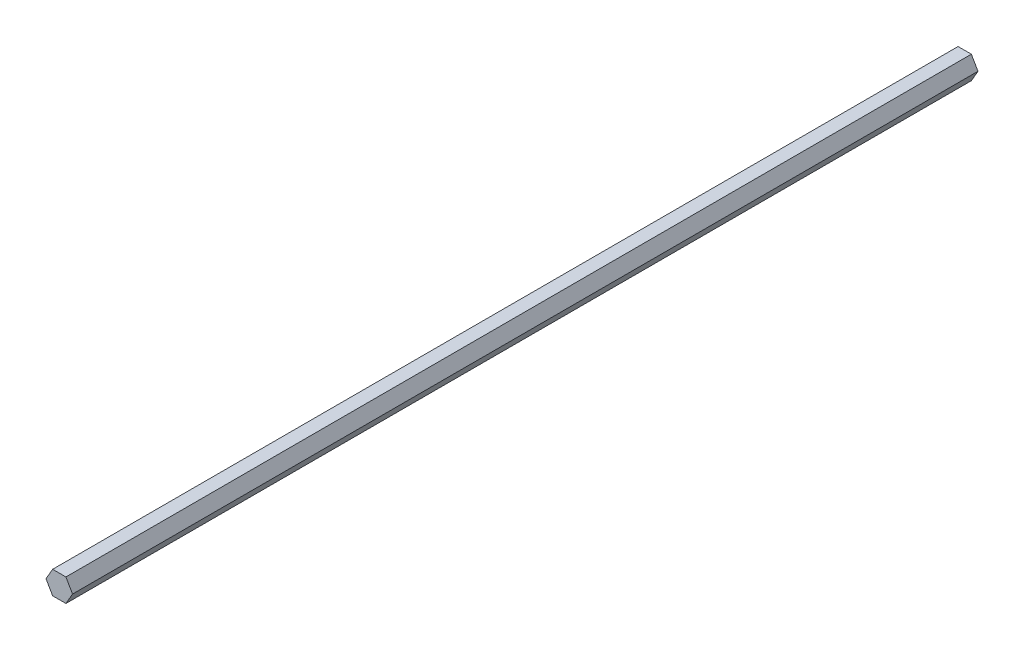
ISO-10303-21;
HEADER;
FILE_DESCRIPTION(('STEP AP214'),'2;1');
FILE_NAME('part.step','',(''),(''),'','','');
FILE_SCHEMA(('AUTOMOTIVE_DESIGN { 1 0 10303 214 1 1 1 1 }'));
ENDSEC;
DATA;
#1=APPLICATION_CONTEXT('core data for automotive mechanical design processes');
#2=APPLICATION_PROTOCOL_DEFINITION('international standard','automotive_design',2000,#1);
#3=PRODUCT_CONTEXT('',#1,'mechanical');
#4=PRODUCT('Part','Part','',(#3));
#5=PRODUCT_RELATED_PRODUCT_CATEGORY('part','',(#4));
#6=PRODUCT_DEFINITION_FORMATION('','',#4);
#7=PRODUCT_DEFINITION_CONTEXT('part definition',#1,'design');
#8=PRODUCT_DEFINITION('design','',#6,#7);
#9=PRODUCT_DEFINITION_SHAPE('','',#8);
#10=(LENGTH_UNIT() NAMED_UNIT(*) SI_UNIT(.MILLI.,.METRE.));
#11=(NAMED_UNIT(*) PLANE_ANGLE_UNIT() SI_UNIT($,.RADIAN.));
#12=(NAMED_UNIT(*) SI_UNIT($,.STERADIAN.) SOLID_ANGLE_UNIT());
#13=UNCERTAINTY_MEASURE_WITH_UNIT(LENGTH_MEASURE(1.E-05),#10,'distance_accuracy_value','');
#14=(GEOMETRIC_REPRESENTATION_CONTEXT(3) GLOBAL_UNCERTAINTY_ASSIGNED_CONTEXT((#13)) GLOBAL_UNIT_ASSIGNED_CONTEXT((#10,
#11,#12)) REPRESENTATION_CONTEXT('',''));
#15=CARTESIAN_POINT('',(0.,0.,0.));
#16=DIRECTION('',(0.,0.,1.));
#17=DIRECTION('',(1.,0.,0.));
#18=AXIS2_PLACEMENT_3D('',#15,#16,#17);
#19=CARTESIAN_POINT('',(3.665,6.34796620973994,500.));
#20=DIRECTION('',(0.,-1.,0.));
#21=DIRECTION('',(1.,0.,0.));
#22=AXIS2_PLACEMENT_3D('',#19,#20,#21);
#23=PLANE('',#22);
#24=DIRECTION('',(-1.,0.,0.));
#25=VECTOR('',#24,1.);
#26=CARTESIAN_POINT('',(3.665,6.34796620973994,0.));
#27=LINE('',#26,#25);
#28=CARTESIAN_POINT('',(3.665,6.34796620973994,0.));
#29=VERTEX_POINT('',#28);
#30=CARTESIAN_POINT('',(-3.665,6.34796620973993,0.));
#31=VERTEX_POINT('',#30);
#32=EDGE_CURVE('E116',#29,#31,#27,.T.);
#33=ORIENTED_EDGE('',*,*,#32,.T.);
#34=DIRECTION('',(0.,0.,-1.));
#35=VECTOR('',#34,1.);
#36=CARTESIAN_POINT('',(-3.665,6.34796620973993,500.));
#37=LINE('',#36,#35);
#38=CARTESIAN_POINT('',(-3.665,6.34796620973993,500.));
#39=VERTEX_POINT('',#38);
#40=EDGE_CURVE('E11',#39,#31,#37,.T.);
#41=ORIENTED_EDGE('',*,*,#40,.F.);
#42=DIRECTION('',(-1.,0.,0.));
#43=VECTOR('',#42,1.);
#44=CARTESIAN_POINT('',(3.665,6.34796620973994,500.));
#45=LINE('',#44,#43);
#46=CARTESIAN_POINT('',(3.665,6.34796620973994,500.));
#47=VERTEX_POINT('',#46);
#48=EDGE_CURVE('E126',#47,#39,#45,.T.);
#49=ORIENTED_EDGE('',*,*,#48,.F.);
#50=DIRECTION('',(0.,0.,-1.));
#51=VECTOR('',#50,1.);
#52=CARTESIAN_POINT('',(3.665,6.34796620973994,500.));
#53=LINE('',#52,#51);
#54=EDGE_CURVE('E112',#47,#29,#53,.T.);
#55=ORIENTED_EDGE('',*,*,#54,.T.);
#56=EDGE_LOOP('',(#33,#41,#49,#55));
#57=FACE_BOUND('',#56,.T.);
#58=ADVANCED_FACE('F32',(#57),#23,.F.);
#59=CARTESIAN_POINT('',(-3.665,6.34796620973993,500.));
#60=DIRECTION('',(0.866025403784439,-0.5,0.));
#61=DIRECTION('',(0.5,0.866025403784439,0.));
#62=AXIS2_PLACEMENT_3D('',#59,#60,#61);
#63=PLANE('',#62);
#64=DIRECTION('',(-0.5,-0.866025403784439,0.));
#65=VECTOR('',#64,1.);
#66=CARTESIAN_POINT('',(-3.665,6.34796620973993,0.));
#67=LINE('',#66,#65);
#68=CARTESIAN_POINT('',(-7.33,0.,0.));
#69=VERTEX_POINT('',#68);
#70=EDGE_CURVE('E119',#31,#69,#67,.T.);
#71=ORIENTED_EDGE('',*,*,#70,.T.);
#72=DIRECTION('',(0.,0.,-1.));
#73=VECTOR('',#72,1.);
#74=CARTESIAN_POINT('',(-7.33,0.,500.));
#75=LINE('',#74,#73);
#76=CARTESIAN_POINT('',(-7.33,0.,500.));
#77=VERTEX_POINT('',#76);
#78=EDGE_CURVE('E40',#77,#69,#75,.T.);
#79=ORIENTED_EDGE('',*,*,#78,.F.);
#80=DIRECTION('',(-0.5,-0.866025403784439,0.));
#81=VECTOR('',#80,1.);
#82=CARTESIAN_POINT('',(-3.665,6.34796620973993,500.));
#83=LINE('',#82,#81);
#84=EDGE_CURVE('E85',#39,#77,#83,.T.);
#85=ORIENTED_EDGE('',*,*,#84,.F.);
#86=ORIENTED_EDGE('',*,*,#40,.T.);
#87=EDGE_LOOP('',(#71,#79,#85,#86));
#88=FACE_BOUND('',#87,.T.);
#89=ADVANCED_FACE('F150',(#88),#63,.F.);
#90=CARTESIAN_POINT('',(-7.33,0.,500.));
#91=DIRECTION('',(0.866025403784439,0.5,0.));
#92=DIRECTION('',(-0.5,0.866025403784439,0.));
#93=AXIS2_PLACEMENT_3D('',#90,#91,#92);
#94=PLANE('',#93);
#95=DIRECTION('',(0.5,-0.866025403784439,0.));
#96=VECTOR('',#95,1.);
#97=CARTESIAN_POINT('',(-7.33,0.,0.));
#98=LINE('',#97,#96);
#99=CARTESIAN_POINT('',(-3.665,-6.34796620973994,0.));
#100=VERTEX_POINT('',#99);
#101=EDGE_CURVE('E121',#69,#100,#98,.T.);
#102=ORIENTED_EDGE('',*,*,#101,.T.);
#103=DIRECTION('',(0.,0.,-1.));
#104=VECTOR('',#103,1.);
#105=CARTESIAN_POINT('',(-3.665,-6.34796620973994,500.));
#106=LINE('',#105,#104);
#107=CARTESIAN_POINT('',(-3.665,-6.34796620973994,500.));
#108=VERTEX_POINT('',#107);
#109=EDGE_CURVE('E107',#108,#100,#106,.T.);
#110=ORIENTED_EDGE('',*,*,#109,.F.);
#111=DIRECTION('',(0.5,-0.866025403784439,0.));
#112=VECTOR('',#111,1.);
#113=CARTESIAN_POINT('',(-7.33,0.,500.));
#114=LINE('',#113,#112);
#115=EDGE_CURVE('E98',#77,#108,#114,.T.);
#116=ORIENTED_EDGE('',*,*,#115,.F.);
#117=ORIENTED_EDGE('',*,*,#78,.T.);
#118=EDGE_LOOP('',(#102,#110,#116,#117));
#119=FACE_BOUND('',#118,.T.);
#120=ADVANCED_FACE('F132',(#119),#94,.F.);
#121=CARTESIAN_POINT('',(-3.665,-6.34796620973994,500.));
#122=DIRECTION('',(0.,1.,0.));
#123=DIRECTION('',(-1.,0.,0.));
#124=AXIS2_PLACEMENT_3D('',#121,#122,#123);
#125=PLANE('',#124);
#126=DIRECTION('',(1.,0.,0.));
#127=VECTOR('',#126,1.);
#128=CARTESIAN_POINT('',(-3.665,-6.34796620973994,0.));
#129=LINE('',#128,#127);
#130=CARTESIAN_POINT('',(3.665,-6.34796620973994,0.));
#131=VERTEX_POINT('',#130);
#132=EDGE_CURVE('E106',#100,#131,#129,.T.);
#133=ORIENTED_EDGE('',*,*,#132,.T.);
#134=DIRECTION('',(0.,0.,-1.));
#135=VECTOR('',#134,1.);
#136=CARTESIAN_POINT('',(3.665,-6.34796620973994,500.));
#137=LINE('',#136,#135);
#138=CARTESIAN_POINT('',(3.665,-6.34796620973994,500.));
#139=VERTEX_POINT('',#138);
#140=EDGE_CURVE('E103',#139,#131,#137,.T.);
#141=ORIENTED_EDGE('',*,*,#140,.F.);
#142=DIRECTION('',(1.,0.,0.));
#143=VECTOR('',#142,1.);
#144=CARTESIAN_POINT('',(-3.665,-6.34796620973994,500.));
#145=LINE('',#144,#143);
#146=EDGE_CURVE('E92',#108,#139,#145,.T.);
#147=ORIENTED_EDGE('',*,*,#146,.F.);
#148=ORIENTED_EDGE('',*,*,#109,.T.);
#149=EDGE_LOOP('',(#133,#141,#147,#148));
#150=FACE_BOUND('',#149,.T.);
#151=ADVANCED_FACE('F104',(#150),#125,.F.);
#152=CARTESIAN_POINT('',(3.665,-6.34796620973994,500.));
#153=DIRECTION('',(-0.866025403784439,0.5,0.));
#154=DIRECTION('',(-0.5,-0.866025403784439,0.));
#155=AXIS2_PLACEMENT_3D('',#152,#153,#154);
#156=PLANE('',#155);
#157=DIRECTION('',(0.5,0.866025403784439,0.));
#158=VECTOR('',#157,1.);
#159=CARTESIAN_POINT('',(3.665,-6.34796620973994,0.));
#160=LINE('',#159,#158);
#161=CARTESIAN_POINT('',(7.33,0.,0.));
#162=VERTEX_POINT('',#161);
#163=EDGE_CURVE('E71',#131,#162,#160,.T.);
#164=ORIENTED_EDGE('',*,*,#163,.T.);
#165=DIRECTION('',(0.,0.,-1.));
#166=VECTOR('',#165,1.);
#167=CARTESIAN_POINT('',(7.33,0.,500.));
#168=LINE('',#167,#166);
#169=CARTESIAN_POINT('',(7.33,0.,500.));
#170=VERTEX_POINT('',#169);
#171=EDGE_CURVE('E108',#170,#162,#168,.T.);
#172=ORIENTED_EDGE('',*,*,#171,.F.);
#173=DIRECTION('',(0.5,0.866025403784439,0.));
#174=VECTOR('',#173,1.);
#175=CARTESIAN_POINT('',(3.665,-6.34796620973994,500.));
#176=LINE('',#175,#174);
#177=EDGE_CURVE('E96',#139,#170,#176,.T.);
#178=ORIENTED_EDGE('',*,*,#177,.F.);
#179=ORIENTED_EDGE('',*,*,#140,.T.);
#180=EDGE_LOOP('',(#164,#172,#178,#179));
#181=FACE_BOUND('',#180,.T.);
#182=ADVANCED_FACE('F110',(#181),#156,.F.);
#183=CARTESIAN_POINT('',(7.33,0.,500.));
#184=DIRECTION('',(-0.866025403784439,-0.5,0.));
#185=DIRECTION('',(0.5,-0.866025403784439,0.));
#186=AXIS2_PLACEMENT_3D('',#183,#184,#185);
#187=PLANE('',#186);
#188=DIRECTION('',(-0.5,0.866025403784439,0.));
#189=VECTOR('',#188,1.);
#190=CARTESIAN_POINT('',(7.33,0.,0.));
#191=LINE('',#190,#189);
#192=EDGE_CURVE('E77',#162,#29,#191,.T.);
#193=ORIENTED_EDGE('',*,*,#192,.T.);
#194=ORIENTED_EDGE('',*,*,#54,.F.);
#195=DIRECTION('',(-0.5,0.866025403784439,0.));
#196=VECTOR('',#195,1.);
#197=CARTESIAN_POINT('',(7.33,0.,500.));
#198=LINE('',#197,#196);
#199=EDGE_CURVE('E48',#170,#47,#198,.T.);
#200=ORIENTED_EDGE('',*,*,#199,.F.);
#201=ORIENTED_EDGE('',*,*,#171,.T.);
#202=EDGE_LOOP('',(#193,#194,#200,#201));
#203=FACE_BOUND('',#202,.T.);
#204=ADVANCED_FACE('F139',(#203),#187,.F.);
#205=CARTESIAN_POINT('',(0.,0.,500.));
#206=DIRECTION('',(0.,0.,1.));
#207=DIRECTION('',(1.,0.,0.));
#208=AXIS2_PLACEMENT_3D('',#205,#206,#207);
#209=PLANE('',#208);
#210=ORIENTED_EDGE('',*,*,#48,.T.);
#211=ORIENTED_EDGE('',*,*,#84,.T.);
#212=ORIENTED_EDGE('',*,*,#115,.T.);
#213=ORIENTED_EDGE('',*,*,#146,.T.);
#214=ORIENTED_EDGE('',*,*,#177,.T.);
#215=ORIENTED_EDGE('',*,*,#199,.T.);
#216=EDGE_LOOP('',(#210,#211,#212,#213,#214,#215));
#217=FACE_BOUND('',#216,.T.);
#218=ADVANCED_FACE('F94',(#217),#209,.T.);
#219=CARTESIAN_POINT('',(0.,0.,0.));
#220=DIRECTION('',(0.,0.,1.));
#221=DIRECTION('',(1.,0.,0.));
#222=AXIS2_PLACEMENT_3D('',#219,#220,#221);
#223=PLANE('',#222);
#224=ORIENTED_EDGE('',*,*,#32,.F.);
#225=ORIENTED_EDGE('',*,*,#192,.F.);
#226=ORIENTED_EDGE('',*,*,#163,.F.);
#227=ORIENTED_EDGE('',*,*,#132,.F.);
#228=ORIENTED_EDGE('',*,*,#101,.F.);
#229=ORIENTED_EDGE('',*,*,#70,.F.);
#230=EDGE_LOOP('',(#224,#225,#226,#227,#228,#229));
#231=FACE_BOUND('',#230,.T.);
#232=ADVANCED_FACE('F135',(#231),#223,.F.);
#233=CLOSED_SHELL('',(#58,#89,#120,#151,#182,#204,#218,#232));
#234=MANIFOLD_SOLID_BREP('B2',#233);
#235=ADVANCED_BREP_SHAPE_REPRESENTATION('',(#18,#234),#14);
#236=SHAPE_DEFINITION_REPRESENTATION(#9,#235);
ENDSEC;
END-ISO-10303-21;
